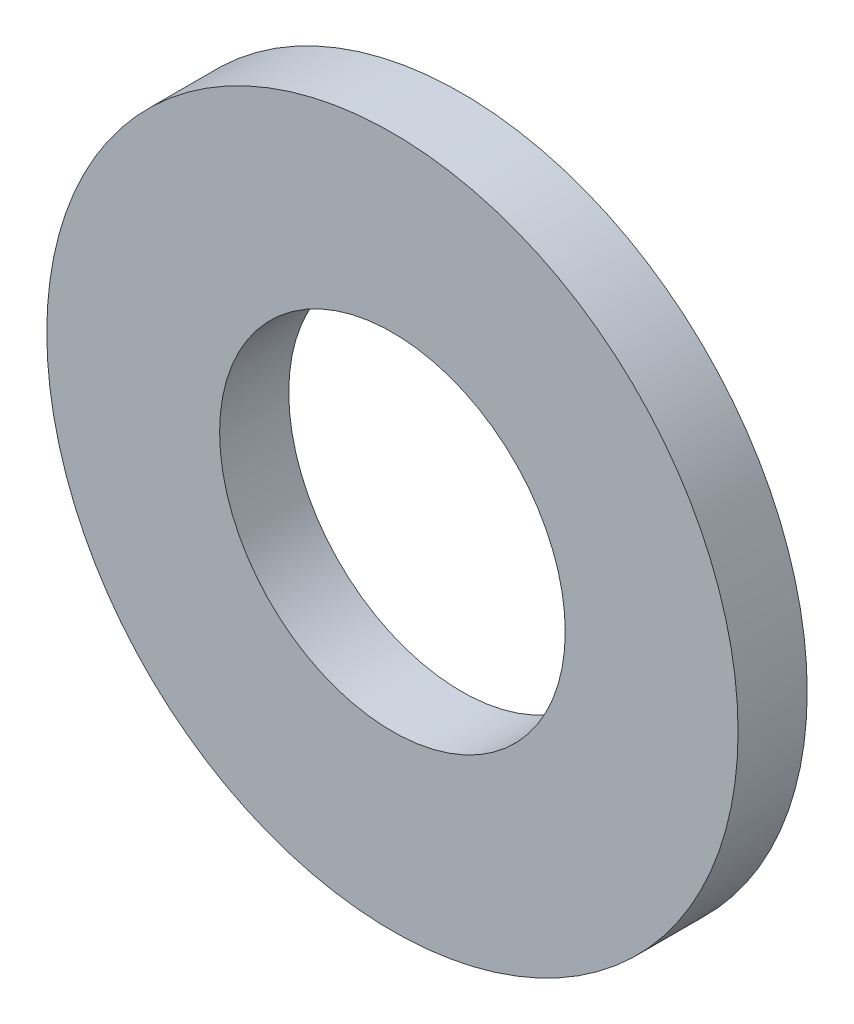
ISO-10303-21;
HEADER;
FILE_DESCRIPTION(('STEP AP214'),'2;1');
FILE_NAME('part.step','',(''),(''),'','','');
FILE_SCHEMA(('AUTOMOTIVE_DESIGN { 1 0 10303 214 1 1 1 1 }'));
ENDSEC;
DATA;
#1=APPLICATION_CONTEXT('core data for automotive mechanical design processes');
#2=APPLICATION_PROTOCOL_DEFINITION('international standard','automotive_design',2000,#1);
#3=PRODUCT_CONTEXT('',#1,'mechanical');
#4=PRODUCT('Part','Part','',(#3));
#5=PRODUCT_RELATED_PRODUCT_CATEGORY('part','',(#4));
#6=PRODUCT_DEFINITION_FORMATION('','',#4);
#7=PRODUCT_DEFINITION_CONTEXT('part definition',#1,'design');
#8=PRODUCT_DEFINITION('design','',#6,#7);
#9=PRODUCT_DEFINITION_SHAPE('','',#8);
#10=(LENGTH_UNIT() NAMED_UNIT(*) SI_UNIT(.MILLI.,.METRE.));
#11=(NAMED_UNIT(*) PLANE_ANGLE_UNIT() SI_UNIT($,.RADIAN.));
#12=(NAMED_UNIT(*) SI_UNIT($,.STERADIAN.) SOLID_ANGLE_UNIT());
#13=UNCERTAINTY_MEASURE_WITH_UNIT(LENGTH_MEASURE(1.E-05),#10,'distance_accuracy_value','');
#14=(GEOMETRIC_REPRESENTATION_CONTEXT(3) GLOBAL_UNCERTAINTY_ASSIGNED_CONTEXT((#13)) GLOBAL_UNIT_ASSIGNED_CONTEXT((#10,
#11,#12)) REPRESENTATION_CONTEXT('',''));
#15=CARTESIAN_POINT('',(0.,0.,0.));
#16=DIRECTION('',(0.,0.,1.));
#17=DIRECTION('',(1.,0.,0.));
#18=AXIS2_PLACEMENT_3D('',#15,#16,#17);
#19=CARTESIAN_POINT('',(0.,0.,1.5875));
#20=DIRECTION('',(0.,0.,1.));
#21=DIRECTION('',(1.,0.,0.));
#22=AXIS2_PLACEMENT_3D('',#19,#20,#21);
#23=PLANE('',#22);
#24=CARTESIAN_POINT('',(0.,0.,1.5875));
#25=DIRECTION('',(0.,0.,1.));
#26=DIRECTION('',(1.,0.,0.));
#27=AXIS2_PLACEMENT_3D('',#24,#25,#26);
#28=CIRCLE('',#27,7.9375);
#29=CARTESIAN_POINT('',(7.9375,0.,1.5875));
#30=VERTEX_POINT('',#29);
#31=EDGE_CURVE('E10',#30,#30,#28,.T.);
#32=ORIENTED_EDGE('',*,*,#31,.T.);
#33=EDGE_LOOP('',(#32));
#34=FACE_BOUND('',#33,.T.);
#35=CARTESIAN_POINT('',(0.,0.,1.5875));
#36=DIRECTION('',(0.,0.,1.));
#37=DIRECTION('',(1.,0.,0.));
#38=AXIS2_PLACEMENT_3D('',#35,#36,#37);
#39=CIRCLE('',#38,3.96875);
#40=CARTESIAN_POINT('',(3.96875,0.,1.5875));
#41=VERTEX_POINT('',#40);
#42=EDGE_CURVE('E41',#41,#41,#39,.T.);
#43=ORIENTED_EDGE('',*,*,#42,.F.);
#44=EDGE_LOOP('',(#43));
#45=FACE_BOUND('',#44,.T.);
#46=ADVANCED_FACE('F30',(#34,#45),#23,.T.);
#47=CARTESIAN_POINT('',(0.,0.,0.));
#48=DIRECTION('',(0.,0.,1.));
#49=DIRECTION('',(1.,0.,0.));
#50=AXIS2_PLACEMENT_3D('',#47,#48,#49);
#51=PLANE('',#50);
#52=CARTESIAN_POINT('',(0.,0.,0.));
#53=DIRECTION('',(0.,0.,1.));
#54=DIRECTION('',(1.,0.,0.));
#55=AXIS2_PLACEMENT_3D('',#52,#53,#54);
#56=CIRCLE('',#55,7.9375);
#57=CARTESIAN_POINT('',(7.9375,0.,0.));
#58=VERTEX_POINT('',#57);
#59=EDGE_CURVE('E34',#58,#58,#56,.T.);
#60=ORIENTED_EDGE('',*,*,#59,.F.);
#61=EDGE_LOOP('',(#60));
#62=FACE_BOUND('',#61,.T.);
#63=CARTESIAN_POINT('',(0.,0.,0.));
#64=DIRECTION('',(0.,0.,1.));
#65=DIRECTION('',(1.,0.,0.));
#66=AXIS2_PLACEMENT_3D('',#63,#64,#65);
#67=CIRCLE('',#66,3.96875);
#68=CARTESIAN_POINT('',(3.96875,0.,0.));
#69=VERTEX_POINT('',#68);
#70=EDGE_CURVE('E43',#69,#69,#67,.T.);
#71=ORIENTED_EDGE('',*,*,#70,.T.);
#72=EDGE_LOOP('',(#71));
#73=FACE_BOUND('',#72,.T.);
#74=ADVANCED_FACE('F53',(#62,#73),#51,.F.);
#75=CARTESIAN_POINT('',(0.,0.,1.5875));
#76=DIRECTION('',(0.,0.,-1.));
#77=DIRECTION('',(-1.,0.,0.));
#78=AXIS2_PLACEMENT_3D('',#75,#76,#77);
#79=CYLINDRICAL_SURFACE('',#78,7.9375);
#80=ORIENTED_EDGE('',*,*,#31,.F.);
#81=EDGE_LOOP('',(#80));
#82=FACE_BOUND('',#81,.T.);
#83=ORIENTED_EDGE('',*,*,#59,.T.);
#84=EDGE_LOOP('',(#83));
#85=FACE_BOUND('',#84,.T.);
#86=ADVANCED_FACE('F32',(#82,#85),#79,.T.);
#87=CARTESIAN_POINT('',(0.,0.,1.5875));
#88=DIRECTION('',(0.,0.,-1.));
#89=DIRECTION('',(-1.,0.,0.));
#90=AXIS2_PLACEMENT_3D('',#87,#88,#89);
#91=CYLINDRICAL_SURFACE('',#90,3.96875);
#92=ORIENTED_EDGE('',*,*,#42,.T.);
#93=EDGE_LOOP('',(#92));
#94=FACE_BOUND('',#93,.T.);
#95=ORIENTED_EDGE('',*,*,#70,.F.);
#96=EDGE_LOOP('',(#95));
#97=FACE_BOUND('',#96,.T.);
#98=ADVANCED_FACE('F49',(#94,#97),#91,.F.);
#99=CLOSED_SHELL('',(#46,#74,#86,#98));
#100=MANIFOLD_SOLID_BREP('B2',#99);
#101=ADVANCED_BREP_SHAPE_REPRESENTATION('',(#18,#100),#14);
#102=SHAPE_DEFINITION_REPRESENTATION(#9,#101);
ENDSEC;
END-ISO-10303-21;
